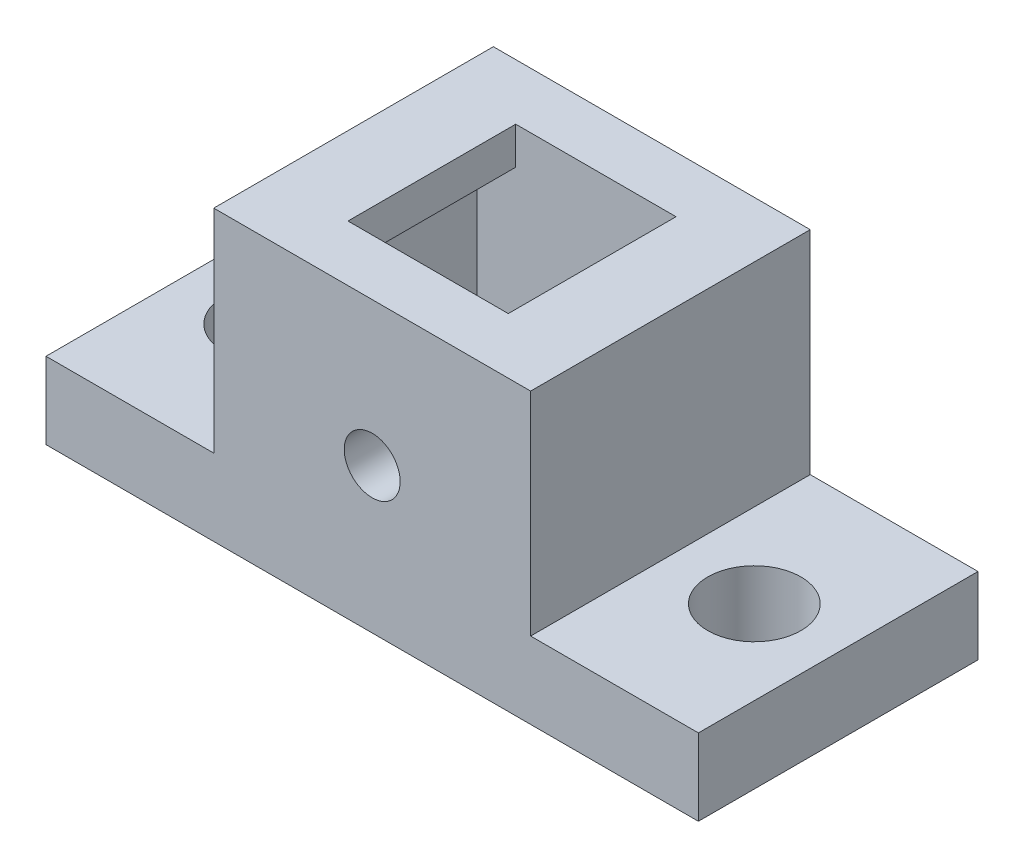
ISO-10303-21;
HEADER;
FILE_DESCRIPTION(('STEP AP214'),'2;1');
FILE_NAME('part.step','',(''),(''),'','','');
FILE_SCHEMA(('AUTOMOTIVE_DESIGN { 1 0 10303 214 1 1 1 1 }'));
ENDSEC;
DATA;
#1=APPLICATION_CONTEXT('core data for automotive mechanical design processes');
#2=APPLICATION_PROTOCOL_DEFINITION('international standard','automotive_design',2000,#1);
#3=PRODUCT_CONTEXT('',#1,'mechanical');
#4=PRODUCT('Part','Part','',(#3));
#5=PRODUCT_RELATED_PRODUCT_CATEGORY('part','',(#4));
#6=PRODUCT_DEFINITION_FORMATION('','',#4);
#7=PRODUCT_DEFINITION_CONTEXT('part definition',#1,'design');
#8=PRODUCT_DEFINITION('design','',#6,#7);
#9=PRODUCT_DEFINITION_SHAPE('','',#8);
#10=(LENGTH_UNIT() NAMED_UNIT(*) SI_UNIT(.MILLI.,.METRE.));
#11=(NAMED_UNIT(*) PLANE_ANGLE_UNIT() SI_UNIT($,.RADIAN.));
#12=(NAMED_UNIT(*) SI_UNIT($,.STERADIAN.) SOLID_ANGLE_UNIT());
#13=UNCERTAINTY_MEASURE_WITH_UNIT(LENGTH_MEASURE(1.E-05),#10,'distance_accuracy_value','');
#14=(GEOMETRIC_REPRESENTATION_CONTEXT(3) GLOBAL_UNCERTAINTY_ASSIGNED_CONTEXT((#13)) GLOBAL_UNIT_ASSIGNED_CONTEXT((#10,
#11,#12)) REPRESENTATION_CONTEXT('',''));
#15=CARTESIAN_POINT('',(0.,0.,0.));
#16=DIRECTION('',(0.,0.,1.));
#17=DIRECTION('',(1.,0.,0.));
#18=AXIS2_PLACEMENT_3D('',#15,#16,#17);
#19=CARTESIAN_POINT('',(0.,23.49,0.));
#20=DIRECTION('',(1.,0.,0.));
#21=DIRECTION('',(0.,0.,-1.));
#22=AXIS2_PLACEMENT_3D('',#19,#20,#21);
#23=PLANE('',#22);
#24=DIRECTION('',(0.,-1.,0.));
#25=VECTOR('',#24,1.);
#26=CARTESIAN_POINT('',(0.,23.49,0.));
#27=LINE('',#26,#25);
#28=CARTESIAN_POINT('',(0.,4.10728917057668,0.));
#29=VERTEX_POINT('',#28);
#30=CARTESIAN_POINT('',(0.,0.,0.));
#31=VERTEX_POINT('',#30);
#32=EDGE_CURVE('E294',#29,#31,#27,.T.);
#33=ORIENTED_EDGE('',*,*,#32,.F.);
#34=DIRECTION('',(0.,0.,-1.));
#35=VECTOR('',#34,1.);
#36=CARTESIAN_POINT('',(0.,4.10728917057668,0.));
#37=LINE('',#36,#35);
#38=CARTESIAN_POINT('',(0.,4.10728917057668,-15.));
#39=VERTEX_POINT('',#38);
#40=EDGE_CURVE('E265',#29,#39,#37,.T.);
#41=ORIENTED_EDGE('',*,*,#40,.T.);
#42=DIRECTION('',(0.,-1.,0.));
#43=VECTOR('',#42,1.);
#44=CARTESIAN_POINT('',(0.,23.49,-15.));
#45=LINE('',#44,#43);
#46=CARTESIAN_POINT('',(0.,0.,-15.));
#47=VERTEX_POINT('',#46);
#48=EDGE_CURVE('E285',#39,#47,#45,.T.);
#49=ORIENTED_EDGE('',*,*,#48,.T.);
#50=DIRECTION('',(0.,0.,1.));
#51=VECTOR('',#50,1.);
#52=CARTESIAN_POINT('',(0.,0.,0.));
#53=LINE('',#52,#51);
#54=EDGE_CURVE('E269',#47,#31,#53,.T.);
#55=ORIENTED_EDGE('',*,*,#54,.T.);
#56=EDGE_LOOP('',(#33,#41,#49,#55));
#57=FACE_BOUND('',#56,.T.);
#58=ADVANCED_FACE('F38',(#57),#23,.F.);
#59=CARTESIAN_POINT('',(0.,23.49,0.));
#60=DIRECTION('',(0.,0.,-1.));
#61=DIRECTION('',(-1.,0.,0.));
#62=AXIS2_PLACEMENT_3D('',#59,#60,#61);
#63=PLANE('',#62);
#64=CARTESIAN_POINT('',(17.5,7.78047744554944,0.));
#65=DIRECTION('',(0.,0.,1.));
#66=DIRECTION('',(1.,0.,0.));
#67=AXIS2_PLACEMENT_3D('',#64,#65,#66);
#68=CIRCLE('',#67,1.5);
#69=CARTESIAN_POINT('',(19.,7.78047744554944,0.));
#70=VERTEX_POINT('',#69);
#71=EDGE_CURVE('E438',#70,#70,#68,.T.);
#72=ORIENTED_EDGE('',*,*,#71,.F.);
#73=EDGE_LOOP('',(#72));
#74=FACE_BOUND('',#73,.T.);
#75=DIRECTION('',(0.,-1.,0.));
#76=VECTOR('',#75,1.);
#77=CARTESIAN_POINT('',(26.,37.007513533549,0.));
#78=LINE('',#77,#76);
#79=CARTESIAN_POINT('',(26.,15.49,0.));
#80=VERTEX_POINT('',#79);
#81=CARTESIAN_POINT('',(26.,4.10728917057668,0.));
#82=VERTEX_POINT('',#81);
#83=EDGE_CURVE('E233',#80,#82,#78,.T.);
#84=ORIENTED_EDGE('',*,*,#83,.F.);
#85=DIRECTION('',(1.,0.,0.));
#86=VECTOR('',#85,1.);
#87=CARTESIAN_POINT('',(9.,15.49,0.));
#88=LINE('',#87,#86);
#89=CARTESIAN_POINT('',(9.,15.49,0.));
#90=VERTEX_POINT('',#89);
#91=EDGE_CURVE('E217',#90,#80,#88,.T.);
#92=ORIENTED_EDGE('',*,*,#91,.F.);
#93=DIRECTION('',(0.,1.,0.));
#94=VECTOR('',#93,1.);
#95=CARTESIAN_POINT('',(9.,37.007513533549,0.));
#96=LINE('',#95,#94);
#97=CARTESIAN_POINT('',(9.,4.10728917057668,0.));
#98=VERTEX_POINT('',#97);
#99=EDGE_CURVE('E238',#98,#90,#96,.T.);
#100=ORIENTED_EDGE('',*,*,#99,.F.);
#101=DIRECTION('',(1.,0.,0.));
#102=VECTOR('',#101,1.);
#103=CARTESIAN_POINT('',(-14.0053034981097,4.10728917057668,0.));
#104=LINE('',#103,#102);
#105=EDGE_CURVE('E234',#29,#98,#104,.T.);
#106=ORIENTED_EDGE('',*,*,#105,.F.);
#107=ORIENTED_EDGE('',*,*,#32,.T.);
#108=DIRECTION('',(1.,0.,0.));
#109=VECTOR('',#108,1.);
#110=CARTESIAN_POINT('',(0.,0.,0.));
#111=LINE('',#110,#109);
#112=CARTESIAN_POINT('',(35.,0.,0.));
#113=VERTEX_POINT('',#112);
#114=EDGE_CURVE('E273',#31,#113,#111,.T.);
#115=ORIENTED_EDGE('',*,*,#114,.T.);
#116=DIRECTION('',(0.,-1.,0.));
#117=VECTOR('',#116,1.);
#118=CARTESIAN_POINT('',(35.,23.49,0.));
#119=LINE('',#118,#117);
#120=CARTESIAN_POINT('',(35.,4.10728917057668,0.));
#121=VERTEX_POINT('',#120);
#122=EDGE_CURVE('E291',#121,#113,#119,.T.);
#123=ORIENTED_EDGE('',*,*,#122,.F.);
#124=DIRECTION('',(1.,0.,0.));
#125=VECTOR('',#124,1.);
#126=CARTESIAN_POINT('',(26.,4.10728917057668,0.));
#127=LINE('',#126,#125);
#128=EDGE_CURVE('E249',#82,#121,#127,.T.);
#129=ORIENTED_EDGE('',*,*,#128,.F.);
#130=EDGE_LOOP('',(#84,#92,#100,#106,#107,#115,#123,#129));
#131=FACE_BOUND('',#130,.T.);
#132=ADVANCED_FACE('F316',(#74,#131),#63,.F.);
#133=CARTESIAN_POINT('',(35.,23.49,0.));
#134=DIRECTION('',(-1.,0.,0.));
#135=DIRECTION('',(0.,0.,1.));
#136=AXIS2_PLACEMENT_3D('',#133,#134,#135);
#137=PLANE('',#136);
#138=DIRECTION('',(0.,-1.,0.));
#139=VECTOR('',#138,1.);
#140=CARTESIAN_POINT('',(35.,23.49,-15.));
#141=LINE('',#140,#139);
#142=CARTESIAN_POINT('',(35.,4.10728917057668,-15.));
#143=VERTEX_POINT('',#142);
#144=CARTESIAN_POINT('',(35.,0.,-15.));
#145=VERTEX_POINT('',#144);
#146=EDGE_CURVE('E288',#143,#145,#141,.T.);
#147=ORIENTED_EDGE('',*,*,#146,.F.);
#148=DIRECTION('',(0.,0.,1.));
#149=VECTOR('',#148,1.);
#150=CARTESIAN_POINT('',(35.,4.10728917057668,0.));
#151=LINE('',#150,#149);
#152=EDGE_CURVE('E261',#143,#121,#151,.T.);
#153=ORIENTED_EDGE('',*,*,#152,.T.);
#154=ORIENTED_EDGE('',*,*,#122,.T.);
#155=DIRECTION('',(0.,0.,-1.));
#156=VECTOR('',#155,1.);
#157=CARTESIAN_POINT('',(35.,0.,0.));
#158=LINE('',#157,#156);
#159=EDGE_CURVE('E277',#113,#145,#158,.T.);
#160=ORIENTED_EDGE('',*,*,#159,.T.);
#161=EDGE_LOOP('',(#147,#153,#154,#160));
#162=FACE_BOUND('',#161,.T.);
#163=ADVANCED_FACE('F325',(#162),#137,.F.);
#164=CARTESIAN_POINT('',(0.,23.49,-15.));
#165=DIRECTION('',(0.,0.,1.));
#166=DIRECTION('',(1.,0.,0.));
#167=AXIS2_PLACEMENT_3D('',#164,#165,#166);
#168=PLANE('',#167);
#169=CARTESIAN_POINT('',(17.5,7.78047744554944,-15.));
#170=DIRECTION('',(0.,0.,1.));
#171=DIRECTION('',(1.,0.,0.));
#172=AXIS2_PLACEMENT_3D('',#169,#170,#171);
#173=CIRCLE('',#172,1.5);
#174=CARTESIAN_POINT('',(19.,7.78047744554944,-15.));
#175=VERTEX_POINT('',#174);
#176=EDGE_CURVE('E442',#175,#175,#173,.T.);
#177=ORIENTED_EDGE('',*,*,#176,.T.);
#178=EDGE_LOOP('',(#177));
#179=FACE_BOUND('',#178,.T.);
#180=DIRECTION('',(0.,1.,0.));
#181=VECTOR('',#180,1.);
#182=CARTESIAN_POINT('',(9.,23.49,-15.));
#183=LINE('',#182,#181);
#184=CARTESIAN_POINT('',(9.,4.10728917057668,-15.));
#185=VERTEX_POINT('',#184);
#186=CARTESIAN_POINT('',(9.,15.49,-15.));
#187=VERTEX_POINT('',#186);
#188=EDGE_CURVE('E257',#185,#187,#183,.T.);
#189=ORIENTED_EDGE('',*,*,#188,.T.);
#190=DIRECTION('',(1.,0.,0.));
#191=VECTOR('',#190,1.);
#192=CARTESIAN_POINT('',(0.,15.49,-15.));
#193=LINE('',#192,#191);
#194=CARTESIAN_POINT('',(26.,15.49,-15.));
#195=VERTEX_POINT('',#194);
#196=EDGE_CURVE('E62',#187,#195,#193,.T.);
#197=ORIENTED_EDGE('',*,*,#196,.T.);
#198=DIRECTION('',(0.,-1.,0.));
#199=VECTOR('',#198,1.);
#200=CARTESIAN_POINT('',(26.,23.49,-15.));
#201=LINE('',#200,#199);
#202=CARTESIAN_POINT('',(26.,4.10728917057668,-15.));
#203=VERTEX_POINT('',#202);
#204=EDGE_CURVE('E246',#195,#203,#201,.T.);
#205=ORIENTED_EDGE('',*,*,#204,.T.);
#206=DIRECTION('',(1.,0.,0.));
#207=VECTOR('',#206,1.);
#208=CARTESIAN_POINT('',(0.,4.10728917057668,-15.));
#209=LINE('',#208,#207);
#210=EDGE_CURVE('E297',#203,#143,#209,.T.);
#211=ORIENTED_EDGE('',*,*,#210,.T.);
#212=ORIENTED_EDGE('',*,*,#146,.T.);
#213=DIRECTION('',(-1.,0.,0.));
#214=VECTOR('',#213,1.);
#215=CARTESIAN_POINT('',(0.,0.,-15.));
#216=LINE('',#215,#214);
#217=EDGE_CURVE('E281',#145,#47,#216,.T.);
#218=ORIENTED_EDGE('',*,*,#217,.T.);
#219=ORIENTED_EDGE('',*,*,#48,.F.);
#220=DIRECTION('',(1.,0.,0.));
#221=VECTOR('',#220,1.);
#222=CARTESIAN_POINT('',(0.,4.10728917057668,-15.));
#223=LINE('',#222,#221);
#224=EDGE_CURVE('E47',#39,#185,#223,.T.);
#225=ORIENTED_EDGE('',*,*,#224,.T.);
#226=EDGE_LOOP('',(#189,#197,#205,#211,#212,#218,#219,#225));
#227=FACE_BOUND('',#226,.T.);
#228=ADVANCED_FACE('F305',(#179,#227),#168,.F.);
#229=CARTESIAN_POINT('',(0.,0.,0.));
#230=DIRECTION('',(0.,-1.,0.));
#231=DIRECTION('',(0.,0.,-1.));
#232=AXIS2_PLACEMENT_3D('',#229,#230,#231);
#233=PLANE('',#232);
#234=CARTESIAN_POINT('',(4.5,0.,-7.5));
#235=DIRECTION('',(0.,1.,0.));
#236=DIRECTION('',(0.,0.,1.));
#237=AXIS2_PLACEMENT_3D('',#234,#235,#236);
#238=CIRCLE('',#237,2.5);
#239=CARTESIAN_POINT('',(4.5,0.,-5.));
#240=VERTEX_POINT('',#239);
#241=EDGE_CURVE('E399',#240,#240,#238,.T.);
#242=ORIENTED_EDGE('',*,*,#241,.T.);
#243=EDGE_LOOP('',(#242));
#244=FACE_BOUND('',#243,.T.);
#245=CARTESIAN_POINT('',(30.5,0.,-7.5));
#246=DIRECTION('',(0.,1.,0.));
#247=DIRECTION('',(0.,0.,1.));
#248=AXIS2_PLACEMENT_3D('',#245,#246,#247);
#249=CIRCLE('',#248,2.5);
#250=CARTESIAN_POINT('',(30.5,0.,-5.));
#251=VERTEX_POINT('',#250);
#252=EDGE_CURVE('E378',#251,#251,#249,.T.);
#253=ORIENTED_EDGE('',*,*,#252,.T.);
#254=EDGE_LOOP('',(#253));
#255=FACE_BOUND('',#254,.T.);
#256=ORIENTED_EDGE('',*,*,#54,.F.);
#257=ORIENTED_EDGE('',*,*,#217,.F.);
#258=ORIENTED_EDGE('',*,*,#159,.F.);
#259=ORIENTED_EDGE('',*,*,#114,.F.);
#260=EDGE_LOOP('',(#256,#257,#258,#259));
#261=FACE_BOUND('',#260,.T.);
#262=ADVANCED_FACE('F321',(#244,#255,#261),#233,.T.);
#263=CARTESIAN_POINT('',(26.,4.10728917057668,-23.49));
#264=DIRECTION('',(0.,-1.,0.));
#265=DIRECTION('',(1.,0.,0.));
#266=AXIS2_PLACEMENT_3D('',#263,#264,#265);
#267=PLANE('',#266);
#268=CARTESIAN_POINT('',(30.5,4.10728917057668,-7.5));
#269=DIRECTION('',(0.,1.,0.));
#270=DIRECTION('',(0.,0.,1.));
#271=AXIS2_PLACEMENT_3D('',#268,#269,#270);
#272=CIRCLE('',#271,2.5);
#273=CARTESIAN_POINT('',(30.5,4.10728917057668,-5.));
#274=VERTEX_POINT('',#273);
#275=EDGE_CURVE('E375',#274,#274,#272,.T.);
#276=ORIENTED_EDGE('',*,*,#275,.F.);
#277=EDGE_LOOP('',(#276));
#278=FACE_BOUND('',#277,.T.);
#279=ORIENTED_EDGE('',*,*,#210,.F.);
#280=DIRECTION('',(0.,0.,1.));
#281=VECTOR('',#280,1.);
#282=CARTESIAN_POINT('',(26.,4.10728917057668,-23.49));
#283=LINE('',#282,#281);
#284=EDGE_CURVE('E239',#203,#82,#283,.T.);
#285=ORIENTED_EDGE('',*,*,#284,.T.);
#286=ORIENTED_EDGE('',*,*,#128,.T.);
#287=ORIENTED_EDGE('',*,*,#152,.F.);
#288=EDGE_LOOP('',(#279,#285,#286,#287));
#289=FACE_BOUND('',#288,.T.);
#290=ADVANCED_FACE('F330',(#278,#289),#267,.F.);
#291=CARTESIAN_POINT('',(26.,37.007513533549,-23.49));
#292=DIRECTION('',(-1.,0.,0.));
#293=DIRECTION('',(0.,-1.,0.));
#294=AXIS2_PLACEMENT_3D('',#291,#292,#293);
#295=PLANE('',#294);
#296=ORIENTED_EDGE('',*,*,#204,.F.);
#297=DIRECTION('',(0.,0.,1.));
#298=VECTOR('',#297,1.);
#299=CARTESIAN_POINT('',(26.,15.49,-23.49));
#300=LINE('',#299,#298);
#301=EDGE_CURVE('E227',#195,#80,#300,.T.);
#302=ORIENTED_EDGE('',*,*,#301,.T.);
#303=ORIENTED_EDGE('',*,*,#83,.T.);
#304=ORIENTED_EDGE('',*,*,#284,.F.);
#305=EDGE_LOOP('',(#296,#302,#303,#304));
#306=FACE_BOUND('',#305,.T.);
#307=ADVANCED_FACE('F334',(#306),#295,.F.);
#308=CARTESIAN_POINT('',(-14.0053034981097,4.10728917057668,-23.49));
#309=DIRECTION('',(0.,-1.,0.));
#310=DIRECTION('',(0.,0.,-1.));
#311=AXIS2_PLACEMENT_3D('',#308,#309,#310);
#312=PLANE('',#311);
#313=CARTESIAN_POINT('',(4.5,4.10728917057668,-7.5));
#314=DIRECTION('',(0.,1.,0.));
#315=DIRECTION('',(0.,0.,1.));
#316=AXIS2_PLACEMENT_3D('',#313,#314,#315);
#317=CIRCLE('',#316,2.5);
#318=CARTESIAN_POINT('',(4.5,4.10728917057668,-5.));
#319=VERTEX_POINT('',#318);
#320=EDGE_CURVE('E384',#319,#319,#317,.T.);
#321=ORIENTED_EDGE('',*,*,#320,.F.);
#322=EDGE_LOOP('',(#321));
#323=FACE_BOUND('',#322,.T.);
#324=ORIENTED_EDGE('',*,*,#105,.T.);
#325=DIRECTION('',(0.,0.,1.));
#326=VECTOR('',#325,1.);
#327=CARTESIAN_POINT('',(9.,4.10728917057668,-23.49));
#328=LINE('',#327,#326);
#329=EDGE_CURVE('E243',#185,#98,#328,.T.);
#330=ORIENTED_EDGE('',*,*,#329,.F.);
#331=ORIENTED_EDGE('',*,*,#224,.F.);
#332=ORIENTED_EDGE('',*,*,#40,.F.);
#333=EDGE_LOOP('',(#324,#330,#331,#332));
#334=FACE_BOUND('',#333,.T.);
#335=ADVANCED_FACE('F308',(#323,#334),#312,.F.);
#336=CARTESIAN_POINT('',(9.,37.007513533549,-23.49));
#337=DIRECTION('',(1.,0.,0.));
#338=DIRECTION('',(0.,1.,0.));
#339=AXIS2_PLACEMENT_3D('',#336,#337,#338);
#340=PLANE('',#339);
#341=ORIENTED_EDGE('',*,*,#99,.T.);
#342=DIRECTION('',(0.,0.,-1.));
#343=VECTOR('',#342,1.);
#344=CARTESIAN_POINT('',(9.,15.49,-23.49));
#345=LINE('',#344,#343);
#346=EDGE_CURVE('E11',#90,#187,#345,.T.);
#347=ORIENTED_EDGE('',*,*,#346,.T.);
#348=ORIENTED_EDGE('',*,*,#188,.F.);
#349=ORIENTED_EDGE('',*,*,#329,.T.);
#350=EDGE_LOOP('',(#341,#347,#348,#349));
#351=FACE_BOUND('',#350,.T.);
#352=ADVANCED_FACE('F337',(#351),#340,.F.);
#353=CARTESIAN_POINT('',(9.,15.49,-23.49));
#354=DIRECTION('',(0.,-1.,0.));
#355=DIRECTION('',(0.,0.,-1.));
#356=AXIS2_PLACEMENT_3D('',#353,#354,#355);
#357=PLANE('',#356);
#358=DIRECTION('',(1.,0.,0.));
#359=VECTOR('',#358,1.);
#360=CARTESIAN_POINT('',(13.2,15.49,-3.));
#361=LINE('',#360,#359);
#362=CARTESIAN_POINT('',(13.2,15.49,-3.));
#363=VERTEX_POINT('',#362);
#364=CARTESIAN_POINT('',(21.8,15.49,-3.));
#365=VERTEX_POINT('',#364);
#366=EDGE_CURVE('E204',#363,#365,#361,.T.);
#367=ORIENTED_EDGE('',*,*,#366,.F.);
#368=DIRECTION('',(0.,0.,1.));
#369=VECTOR('',#368,1.);
#370=CARTESIAN_POINT('',(13.2,15.49,-12.));
#371=LINE('',#370,#369);
#372=CARTESIAN_POINT('',(13.2,15.49,-12.));
#373=VERTEX_POINT('',#372);
#374=EDGE_CURVE('E194',#373,#363,#371,.T.);
#375=ORIENTED_EDGE('',*,*,#374,.F.);
#376=DIRECTION('',(-1.,0.,0.));
#377=VECTOR('',#376,1.);
#378=CARTESIAN_POINT('',(13.2,15.49,-12.));
#379=LINE('',#378,#377);
#380=CARTESIAN_POINT('',(21.8,15.49,-12.));
#381=VERTEX_POINT('',#380);
#382=EDGE_CURVE('E199',#381,#373,#379,.T.);
#383=ORIENTED_EDGE('',*,*,#382,.F.);
#384=DIRECTION('',(0.,0.,-1.));
#385=VECTOR('',#384,1.);
#386=CARTESIAN_POINT('',(21.8,15.49,-12.));
#387=LINE('',#386,#385);
#388=EDGE_CURVE('E207',#365,#381,#387,.T.);
#389=ORIENTED_EDGE('',*,*,#388,.F.);
#390=EDGE_LOOP('',(#367,#375,#383,#389));
#391=FACE_BOUND('',#390,.T.);
#392=ORIENTED_EDGE('',*,*,#346,.F.);
#393=ORIENTED_EDGE('',*,*,#91,.T.);
#394=ORIENTED_EDGE('',*,*,#301,.F.);
#395=ORIENTED_EDGE('',*,*,#196,.F.);
#396=EDGE_LOOP('',(#392,#393,#394,#395));
#397=FACE_BOUND('',#396,.T.);
#398=ADVANCED_FACE('F335',(#391,#397),#357,.F.);
#399=CARTESIAN_POINT('',(13.2,2.99,-12.));
#400=DIRECTION('',(-1.,0.,0.));
#401=DIRECTION('',(0.,0.,1.));
#402=AXIS2_PLACEMENT_3D('',#399,#400,#401);
#403=PLANE('',#402);
#404=DIRECTION('',(0.,1.,0.));
#405=VECTOR('',#404,1.);
#406=CARTESIAN_POINT('',(13.2,2.99,-3.));
#407=LINE('',#406,#405);
#408=CARTESIAN_POINT('',(13.2,13.49,-3.));
#409=VERTEX_POINT('',#408);
#410=EDGE_CURVE('E54',#409,#363,#407,.T.);
#411=ORIENTED_EDGE('',*,*,#410,.F.);
#412=DIRECTION('',(0.,0.,-1.));
#413=VECTOR('',#412,1.);
#414=CARTESIAN_POINT('',(13.2,13.49,-12.));
#415=LINE('',#414,#413);
#416=CARTESIAN_POINT('',(13.2,13.49,-12.));
#417=VERTEX_POINT('',#416);
#418=EDGE_CURVE('E185',#409,#417,#415,.T.);
#419=ORIENTED_EDGE('',*,*,#418,.T.);
#420=DIRECTION('',(0.,1.,0.));
#421=VECTOR('',#420,1.);
#422=CARTESIAN_POINT('',(13.2,2.99,-12.));
#423=LINE('',#422,#421);
#424=EDGE_CURVE('E214',#417,#373,#423,.T.);
#425=ORIENTED_EDGE('',*,*,#424,.T.);
#426=ORIENTED_EDGE('',*,*,#374,.T.);
#427=EDGE_LOOP('',(#411,#419,#425,#426));
#428=FACE_BOUND('',#427,.T.);
#429=ADVANCED_FACE('F344',(#428),#403,.F.);
#430=CARTESIAN_POINT('',(13.2,2.99,-12.));
#431=DIRECTION('',(0.,0.,-1.));
#432=DIRECTION('',(-1.,0.,0.));
#433=AXIS2_PLACEMENT_3D('',#430,#431,#432);
#434=PLANE('',#433);
#435=CARTESIAN_POINT('',(17.5,7.78047744554944,-12.));
#436=DIRECTION('',(0.,0.,-1.));
#437=DIRECTION('',(-1.,0.,0.));
#438=AXIS2_PLACEMENT_3D('',#435,#436,#437);
#439=CIRCLE('',#438,1.5);
#440=CARTESIAN_POINT('',(16.,7.78047744554944,-12.));
#441=VERTEX_POINT('',#440);
#442=EDGE_CURVE('E379',#441,#441,#439,.T.);
#443=ORIENTED_EDGE('',*,*,#442,.T.);
#444=EDGE_LOOP('',(#443));
#445=FACE_BOUND('',#444,.T.);
#446=ORIENTED_EDGE('',*,*,#424,.F.);
#447=DIRECTION('',(-1.,0.,0.));
#448=VECTOR('',#447,1.);
#449=CARTESIAN_POINT('',(11.1140598011101,13.49,-12.));
#450=LINE('',#449,#448);
#451=CARTESIAN_POINT('',(11.1140598011101,13.49,-12.));
#452=VERTEX_POINT('',#451);
#453=EDGE_CURVE('E173',#417,#452,#450,.T.);
#454=ORIENTED_EDGE('',*,*,#453,.T.);
#455=DIRECTION('',(0.,-1.,0.));
#456=VECTOR('',#455,1.);
#457=CARTESIAN_POINT('',(11.1140598011101,13.49,-12.));
#458=LINE('',#457,#456);
#459=CARTESIAN_POINT('',(11.1140598011101,2.99,-12.));
#460=VERTEX_POINT('',#459);
#461=EDGE_CURVE('E187',#452,#460,#458,.T.);
#462=ORIENTED_EDGE('',*,*,#461,.T.);
#463=DIRECTION('',(-1.,0.,0.));
#464=VECTOR('',#463,1.);
#465=CARTESIAN_POINT('',(13.2,2.99,-12.));
#466=LINE('',#465,#464);
#467=CARTESIAN_POINT('',(23.9568950899886,2.99,-12.));
#468=VERTEX_POINT('',#467);
#469=EDGE_CURVE('E198',#468,#460,#466,.T.);
#470=ORIENTED_EDGE('',*,*,#469,.F.);
#471=DIRECTION('',(0.,-1.,0.));
#472=VECTOR('',#471,1.);
#473=CARTESIAN_POINT('',(23.9568950899886,13.49,-12.));
#474=LINE('',#473,#472);
#475=CARTESIAN_POINT('',(23.9568950899886,13.49,-12.));
#476=VERTEX_POINT('',#475);
#477=EDGE_CURVE('E181',#476,#468,#474,.T.);
#478=ORIENTED_EDGE('',*,*,#477,.F.);
#479=CARTESIAN_POINT('',(21.8,13.49,-12.));
#480=VERTEX_POINT('',#479);
#481=EDGE_CURVE('E168',#476,#480,#450,.T.);
#482=ORIENTED_EDGE('',*,*,#481,.T.);
#483=DIRECTION('',(0.,1.,0.));
#484=VECTOR('',#483,1.);
#485=CARTESIAN_POINT('',(21.8,2.99,-12.));
#486=LINE('',#485,#484);
#487=EDGE_CURVE('E218',#480,#381,#486,.T.);
#488=ORIENTED_EDGE('',*,*,#487,.T.);
#489=ORIENTED_EDGE('',*,*,#382,.T.);
#490=EDGE_LOOP('',(#446,#454,#462,#470,#478,#482,#488,#489));
#491=FACE_BOUND('',#490,.T.);
#492=ADVANCED_FACE('F411',(#445,#491),#434,.F.);
#493=CARTESIAN_POINT('',(21.8,2.99,-12.));
#494=DIRECTION('',(1.,0.,0.));
#495=DIRECTION('',(0.,0.,-1.));
#496=AXIS2_PLACEMENT_3D('',#493,#494,#495);
#497=PLANE('',#496);
#498=ORIENTED_EDGE('',*,*,#487,.F.);
#499=DIRECTION('',(0.,0.,1.));
#500=VECTOR('',#499,1.);
#501=CARTESIAN_POINT('',(21.8,13.49,-12.));
#502=LINE('',#501,#500);
#503=CARTESIAN_POINT('',(21.8,13.49,-3.));
#504=VERTEX_POINT('',#503);
#505=EDGE_CURVE('E180',#480,#504,#502,.T.);
#506=ORIENTED_EDGE('',*,*,#505,.T.);
#507=DIRECTION('',(0.,1.,0.));
#508=VECTOR('',#507,1.);
#509=CARTESIAN_POINT('',(21.8,2.99,-3.));
#510=LINE('',#509,#508);
#511=EDGE_CURVE('E157',#504,#365,#510,.T.);
#512=ORIENTED_EDGE('',*,*,#511,.T.);
#513=ORIENTED_EDGE('',*,*,#388,.T.);
#514=EDGE_LOOP('',(#498,#506,#512,#513));
#515=FACE_BOUND('',#514,.T.);
#516=ADVANCED_FACE('F420',(#515),#497,.F.);
#517=CARTESIAN_POINT('',(13.2,2.99,-3.));
#518=DIRECTION('',(0.,0.,1.));
#519=DIRECTION('',(1.,0.,0.));
#520=AXIS2_PLACEMENT_3D('',#517,#518,#519);
#521=PLANE('',#520);
#522=CARTESIAN_POINT('',(17.5,7.78047744554944,-3.));
#523=DIRECTION('',(0.,0.,1.));
#524=DIRECTION('',(1.,0.,0.));
#525=AXIS2_PLACEMENT_3D('',#522,#523,#524);
#526=CIRCLE('',#525,1.5);
#527=CARTESIAN_POINT('',(19.,7.78047744554944,-3.));
#528=VERTEX_POINT('',#527);
#529=EDGE_CURVE('E41',#528,#528,#526,.T.);
#530=ORIENTED_EDGE('',*,*,#529,.T.);
#531=EDGE_LOOP('',(#530));
#532=FACE_BOUND('',#531,.T.);
#533=ORIENTED_EDGE('',*,*,#511,.F.);
#534=DIRECTION('',(1.,0.,0.));
#535=VECTOR('',#534,1.);
#536=CARTESIAN_POINT('',(11.1140598011101,13.49,-3.));
#537=LINE('',#536,#535);
#538=CARTESIAN_POINT('',(23.9568950899886,13.49,-3.));
#539=VERTEX_POINT('',#538);
#540=EDGE_CURVE('E152',#504,#539,#537,.T.);
#541=ORIENTED_EDGE('',*,*,#540,.T.);
#542=DIRECTION('',(0.,-1.,0.));
#543=VECTOR('',#542,1.);
#544=CARTESIAN_POINT('',(23.9568950899886,13.49,-3.));
#545=LINE('',#544,#543);
#546=CARTESIAN_POINT('',(23.9568950899886,2.99,-3.));
#547=VERTEX_POINT('',#546);
#548=EDGE_CURVE('E156',#539,#547,#545,.T.);
#549=ORIENTED_EDGE('',*,*,#548,.T.);
#550=DIRECTION('',(1.,0.,0.));
#551=VECTOR('',#550,1.);
#552=CARTESIAN_POINT('',(13.2,2.99,-3.));
#553=LINE('',#552,#551);
#554=CARTESIAN_POINT('',(11.1140598011101,2.99,-3.));
#555=VERTEX_POINT('',#554);
#556=EDGE_CURVE('E195',#555,#547,#553,.T.);
#557=ORIENTED_EDGE('',*,*,#556,.F.);
#558=DIRECTION('',(0.,-1.,0.));
#559=VECTOR('',#558,1.);
#560=CARTESIAN_POINT('',(11.1140598011101,13.49,-3.));
#561=LINE('',#560,#559);
#562=CARTESIAN_POINT('',(11.1140598011101,13.49,-3.));
#563=VERTEX_POINT('',#562);
#564=EDGE_CURVE('E396',#563,#555,#561,.T.);
#565=ORIENTED_EDGE('',*,*,#564,.F.);
#566=EDGE_CURVE('E161',#563,#409,#537,.T.);
#567=ORIENTED_EDGE('',*,*,#566,.T.);
#568=ORIENTED_EDGE('',*,*,#410,.T.);
#569=ORIENTED_EDGE('',*,*,#366,.T.);
#570=EDGE_LOOP('',(#533,#541,#549,#557,#565,#567,#568,#569));
#571=FACE_BOUND('',#570,.T.);
#572=ADVANCED_FACE('F154',(#532,#571),#521,.F.);
#573=CARTESIAN_POINT('',(0.,2.99,0.));
#574=DIRECTION('',(0.,1.,0.));
#575=DIRECTION('',(0.,0.,1.));
#576=AXIS2_PLACEMENT_3D('',#573,#574,#575);
#577=PLANE('',#576);
#578=ORIENTED_EDGE('',*,*,#469,.T.);
#579=DIRECTION('',(0.,0.,1.));
#580=VECTOR('',#579,1.);
#581=CARTESIAN_POINT('',(11.1140598011101,2.99,-3.));
#582=LINE('',#581,#580);
#583=EDGE_CURVE('E162',#460,#555,#582,.T.);
#584=ORIENTED_EDGE('',*,*,#583,.T.);
#585=ORIENTED_EDGE('',*,*,#556,.T.);
#586=DIRECTION('',(0.,0.,-1.));
#587=VECTOR('',#586,1.);
#588=CARTESIAN_POINT('',(23.9568950899886,2.99,-3.));
#589=LINE('',#588,#587);
#590=EDGE_CURVE('E178',#547,#468,#589,.T.);
#591=ORIENTED_EDGE('',*,*,#590,.T.);
#592=EDGE_LOOP('',(#578,#584,#585,#591));
#593=FACE_BOUND('',#592,.T.);
#594=ADVANCED_FACE('F417',(#593),#577,.T.);
#595=CARTESIAN_POINT('',(23.9568950899886,13.49,-3.));
#596=DIRECTION('',(-1.,0.,0.));
#597=DIRECTION('',(0.,0.,1.));
#598=AXIS2_PLACEMENT_3D('',#595,#596,#597);
#599=PLANE('',#598);
#600=ORIENTED_EDGE('',*,*,#590,.F.);
#601=ORIENTED_EDGE('',*,*,#548,.F.);
#602=DIRECTION('',(0.,0.,-1.));
#603=VECTOR('',#602,1.);
#604=CARTESIAN_POINT('',(23.9568950899886,13.49,-3.));
#605=LINE('',#604,#603);
#606=EDGE_CURVE('E165',#539,#476,#605,.T.);
#607=ORIENTED_EDGE('',*,*,#606,.T.);
#608=ORIENTED_EDGE('',*,*,#477,.T.);
#609=EDGE_LOOP('',(#600,#601,#607,#608));
#610=FACE_BOUND('',#609,.T.);
#611=ADVANCED_FACE('F176',(#610),#599,.T.);
#612=CARTESIAN_POINT('',(0.,13.49,0.));
#613=DIRECTION('',(0.,1.,0.));
#614=DIRECTION('',(0.,0.,1.));
#615=AXIS2_PLACEMENT_3D('',#612,#613,#614);
#616=PLANE('',#615);
#617=ORIENTED_EDGE('',*,*,#481,.F.);
#618=ORIENTED_EDGE('',*,*,#606,.F.);
#619=ORIENTED_EDGE('',*,*,#540,.F.);
#620=ORIENTED_EDGE('',*,*,#505,.F.);
#621=EDGE_LOOP('',(#617,#618,#619,#620));
#622=FACE_BOUND('',#621,.T.);
#623=ADVANCED_FACE('F166',(#622),#616,.F.);
#624=ORIENTED_EDGE('',*,*,#566,.F.);
#625=DIRECTION('',(0.,0.,1.));
#626=VECTOR('',#625,1.);
#627=CARTESIAN_POINT('',(11.1140598011101,13.49,-3.));
#628=LINE('',#627,#626);
#629=EDGE_CURVE('E393',#452,#563,#628,.T.);
#630=ORIENTED_EDGE('',*,*,#629,.F.);
#631=ORIENTED_EDGE('',*,*,#453,.F.);
#632=ORIENTED_EDGE('',*,*,#418,.F.);
#633=EDGE_LOOP('',(#624,#630,#631,#632));
#634=FACE_BOUND('',#633,.T.);
#635=ADVANCED_FACE('F428',(#634),#616,.F.);
#636=CARTESIAN_POINT('',(11.1140598011101,13.49,-3.));
#637=DIRECTION('',(1.,0.,0.));
#638=DIRECTION('',(0.,0.,-1.));
#639=AXIS2_PLACEMENT_3D('',#636,#637,#638);
#640=PLANE('',#639);
#641=ORIENTED_EDGE('',*,*,#583,.F.);
#642=ORIENTED_EDGE('',*,*,#461,.F.);
#643=ORIENTED_EDGE('',*,*,#629,.T.);
#644=ORIENTED_EDGE('',*,*,#564,.T.);
#645=EDGE_LOOP('',(#641,#642,#643,#644));
#646=FACE_BOUND('',#645,.T.);
#647=ADVANCED_FACE('F414',(#646),#640,.T.);
#648=CARTESIAN_POINT('',(4.5,0.,-7.5));
#649=DIRECTION('',(0.,1.,0.));
#650=DIRECTION('',(0.,0.,1.));
#651=AXIS2_PLACEMENT_3D('',#648,#649,#650);
#652=CYLINDRICAL_SURFACE('',#651,2.5);
#653=ORIENTED_EDGE('',*,*,#241,.F.);
#654=EDGE_LOOP('',(#653));
#655=FACE_BOUND('',#654,.T.);
#656=ORIENTED_EDGE('',*,*,#320,.T.);
#657=EDGE_LOOP('',(#656));
#658=FACE_BOUND('',#657,.T.);
#659=ADVANCED_FACE('F462',(#655,#658),#652,.F.);
#660=CARTESIAN_POINT('',(30.5,0.,-7.5));
#661=DIRECTION('',(0.,1.,0.));
#662=DIRECTION('',(0.,0.,1.));
#663=AXIS2_PLACEMENT_3D('',#660,#661,#662);
#664=CYLINDRICAL_SURFACE('',#663,2.5);
#665=ORIENTED_EDGE('',*,*,#252,.F.);
#666=EDGE_LOOP('',(#665));
#667=FACE_BOUND('',#666,.T.);
#668=ORIENTED_EDGE('',*,*,#275,.T.);
#669=EDGE_LOOP('',(#668));
#670=FACE_BOUND('',#669,.T.);
#671=ADVANCED_FACE('F454',(#667,#670),#664,.F.);
#672=CARTESIAN_POINT('',(17.5,7.78047744554944,-15.));
#673=DIRECTION('',(0.,0.,1.));
#674=DIRECTION('',(1.,0.,0.));
#675=AXIS2_PLACEMENT_3D('',#672,#673,#674);
#676=CYLINDRICAL_SURFACE('',#675,1.5);
#677=ORIENTED_EDGE('',*,*,#71,.T.);
#678=EDGE_LOOP('',(#677));
#679=FACE_BOUND('',#678,.T.);
#680=ORIENTED_EDGE('',*,*,#529,.F.);
#681=EDGE_LOOP('',(#680));
#682=FACE_BOUND('',#681,.T.);
#683=ADVANCED_FACE('F451',(#679,#682),#676,.F.);
#684=ORIENTED_EDGE('',*,*,#176,.F.);
#685=EDGE_LOOP('',(#684));
#686=FACE_BOUND('',#685,.T.);
#687=ORIENTED_EDGE('',*,*,#442,.F.);
#688=EDGE_LOOP('',(#687));
#689=FACE_BOUND('',#688,.T.);
#690=ADVANCED_FACE('F453',(#686,#689),#676,.F.);
#691=CLOSED_SHELL('',(#58,#132,#163,#228,#262,#290,#307,#335,#352,#398,#429,#492,#516,#572,#594,
#611,#623,#635,#647,#659,#671,#683,#690));
#692=MANIFOLD_SOLID_BREP('B2',#691);
#693=ADVANCED_BREP_SHAPE_REPRESENTATION('',(#18,#692),#14);
#694=SHAPE_DEFINITION_REPRESENTATION(#9,#693);
ENDSEC;
END-ISO-10303-21;
